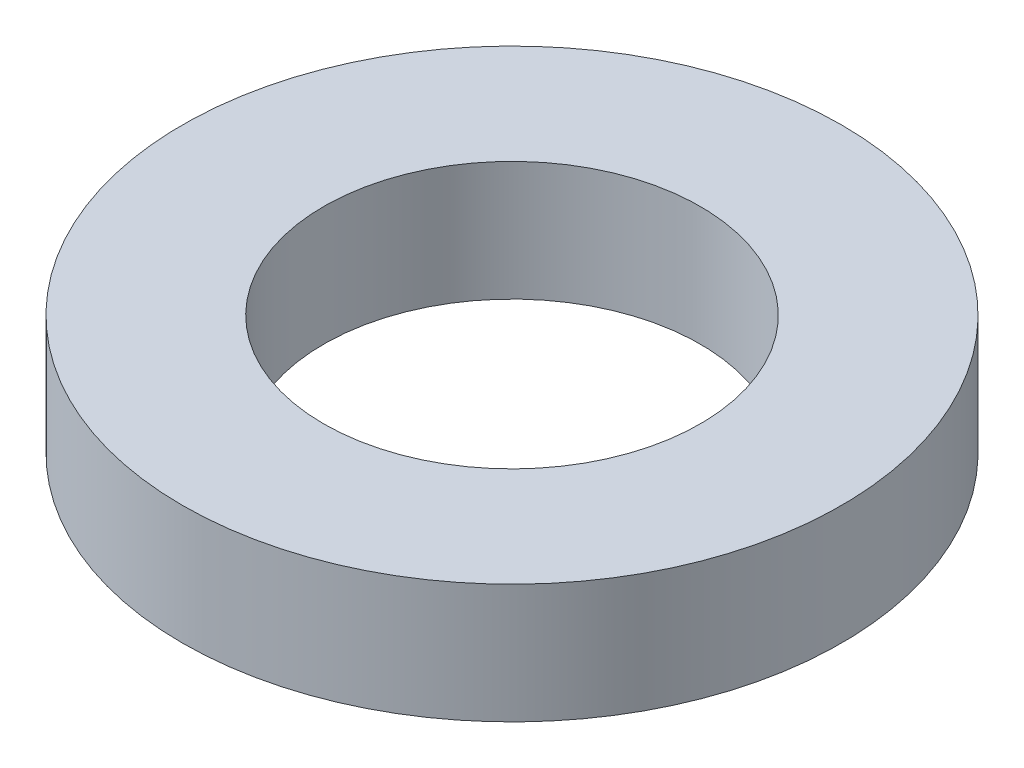
ISO-10303-21;
HEADER;
FILE_DESCRIPTION(('STEP AP214'),'2;1');
FILE_NAME('part.step','',(''),(''),'','','');
FILE_SCHEMA(('AUTOMOTIVE_DESIGN { 1 0 10303 214 1 1 1 1 }'));
ENDSEC;
DATA;
#1=APPLICATION_CONTEXT('core data for automotive mechanical design processes');
#2=APPLICATION_PROTOCOL_DEFINITION('international standard','automotive_design',2000,#1);
#3=PRODUCT_CONTEXT('',#1,'mechanical');
#4=PRODUCT('Part','Part','',(#3));
#5=PRODUCT_RELATED_PRODUCT_CATEGORY('part','',(#4));
#6=PRODUCT_DEFINITION_FORMATION('','',#4);
#7=PRODUCT_DEFINITION_CONTEXT('part definition',#1,'design');
#8=PRODUCT_DEFINITION('design','',#6,#7);
#9=PRODUCT_DEFINITION_SHAPE('','',#8);
#10=(LENGTH_UNIT() NAMED_UNIT(*) SI_UNIT(.MILLI.,.METRE.));
#11=(NAMED_UNIT(*) PLANE_ANGLE_UNIT() SI_UNIT($,.RADIAN.));
#12=(NAMED_UNIT(*) SI_UNIT($,.STERADIAN.) SOLID_ANGLE_UNIT());
#13=UNCERTAINTY_MEASURE_WITH_UNIT(LENGTH_MEASURE(1.E-05),#10,'distance_accuracy_value','');
#14=(GEOMETRIC_REPRESENTATION_CONTEXT(3) GLOBAL_UNCERTAINTY_ASSIGNED_CONTEXT((#13)) GLOBAL_UNIT_ASSIGNED_CONTEXT((#10,
#11,#12)) REPRESENTATION_CONTEXT('',''));
#15=CARTESIAN_POINT('',(0.,0.,0.));
#16=DIRECTION('',(0.,0.,1.));
#17=DIRECTION('',(1.,0.,0.));
#18=AXIS2_PLACEMENT_3D('',#15,#16,#17);
#19=CARTESIAN_POINT('',(0.,19.,0.));
#20=DIRECTION('',(0.,-1.,0.));
#21=DIRECTION('',(0.,0.,-1.));
#22=AXIS2_PLACEMENT_3D('',#19,#20,#21);
#23=CYLINDRICAL_SURFACE('',#22,52.5);
#24=CARTESIAN_POINT('',(0.,19.,0.));
#25=DIRECTION('',(0.,1.,0.));
#26=DIRECTION('',(0.,0.,1.));
#27=AXIS2_PLACEMENT_3D('',#24,#25,#26);
#28=CIRCLE('',#27,52.5);
#29=CARTESIAN_POINT('',(0.,19.,52.5));
#30=VERTEX_POINT('',#29);
#31=EDGE_CURVE('E10',#30,#30,#28,.T.);
#32=ORIENTED_EDGE('',*,*,#31,.F.);
#33=EDGE_LOOP('',(#32));
#34=FACE_BOUND('',#33,.T.);
#35=CARTESIAN_POINT('',(0.,0.,0.));
#36=DIRECTION('',(0.,1.,0.));
#37=DIRECTION('',(0.,0.,1.));
#38=AXIS2_PLACEMENT_3D('',#35,#36,#37);
#39=CIRCLE('',#38,52.5);
#40=CARTESIAN_POINT('',(0.,0.,52.5));
#41=VERTEX_POINT('',#40);
#42=EDGE_CURVE('E37',#41,#41,#39,.T.);
#43=ORIENTED_EDGE('',*,*,#42,.T.);
#44=EDGE_LOOP('',(#43));
#45=FACE_BOUND('',#44,.T.);
#46=ADVANCED_FACE('F40',(#34,#45),#23,.T.);
#47=CARTESIAN_POINT('',(0.,19.,0.));
#48=DIRECTION('',(0.,1.,0.));
#49=DIRECTION('',(0.,0.,1.));
#50=AXIS2_PLACEMENT_3D('',#47,#48,#49);
#51=PLANE('',#50);
#52=CARTESIAN_POINT('',(0.,19.,0.));
#53=DIRECTION('',(0.,1.,0.));
#54=DIRECTION('',(0.,0.,1.));
#55=AXIS2_PLACEMENT_3D('',#52,#53,#54);
#56=CIRCLE('',#55,30.);
#57=CARTESIAN_POINT('',(0.,19.,30.));
#58=VERTEX_POINT('',#57);
#59=EDGE_CURVE('E50',#58,#58,#56,.T.);
#60=ORIENTED_EDGE('',*,*,#59,.F.);
#61=EDGE_LOOP('',(#60));
#62=FACE_BOUND('',#61,.T.);
#63=ORIENTED_EDGE('',*,*,#31,.T.);
#64=EDGE_LOOP('',(#63));
#65=FACE_BOUND('',#64,.T.);
#66=ADVANCED_FACE('F59',(#62,#65),#51,.T.);
#67=CARTESIAN_POINT('',(0.,0.,0.));
#68=DIRECTION('',(0.,1.,0.));
#69=DIRECTION('',(0.,0.,1.));
#70=AXIS2_PLACEMENT_3D('',#67,#68,#69);
#71=PLANE('',#70);
#72=CARTESIAN_POINT('',(0.,0.,0.));
#73=DIRECTION('',(0.,1.,0.));
#74=DIRECTION('',(0.,0.,1.));
#75=AXIS2_PLACEMENT_3D('',#72,#73,#74);
#76=CIRCLE('',#75,30.);
#77=CARTESIAN_POINT('',(0.,0.,30.));
#78=VERTEX_POINT('',#77);
#79=EDGE_CURVE('E47',#78,#78,#76,.T.);
#80=ORIENTED_EDGE('',*,*,#79,.T.);
#81=EDGE_LOOP('',(#80));
#82=FACE_BOUND('',#81,.T.);
#83=ORIENTED_EDGE('',*,*,#42,.F.);
#84=EDGE_LOOP('',(#83));
#85=FACE_BOUND('',#84,.T.);
#86=ADVANCED_FACE('F58',(#82,#85),#71,.F.);
#87=CARTESIAN_POINT('',(0.,19.,0.));
#88=DIRECTION('',(0.,-1.,0.));
#89=DIRECTION('',(0.,0.,-1.));
#90=AXIS2_PLACEMENT_3D('',#87,#88,#89);
#91=CYLINDRICAL_SURFACE('',#90,30.);
#92=ORIENTED_EDGE('',*,*,#59,.T.);
#93=EDGE_LOOP('',(#92));
#94=FACE_BOUND('',#93,.T.);
#95=ORIENTED_EDGE('',*,*,#79,.F.);
#96=EDGE_LOOP('',(#95));
#97=FACE_BOUND('',#96,.T.);
#98=ADVANCED_FACE('F54',(#94,#97),#91,.F.);
#99=CLOSED_SHELL('',(#46,#66,#86,#98));
#100=MANIFOLD_SOLID_BREP('B2',#99);
#101=ADVANCED_BREP_SHAPE_REPRESENTATION('',(#18,#100),#14);
#102=SHAPE_DEFINITION_REPRESENTATION(#9,#101);
ENDSEC;
END-ISO-10303-21;
